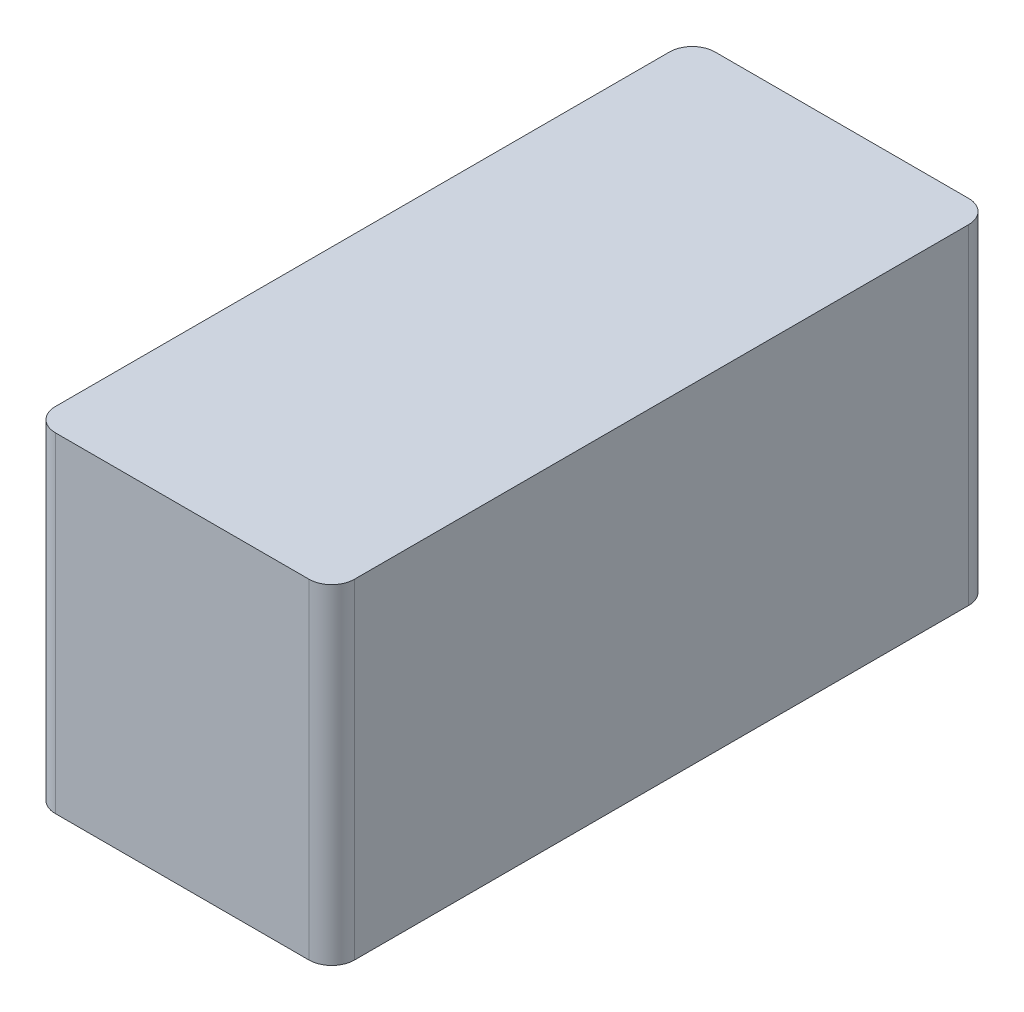
ISO-10303-21;
HEADER;
FILE_DESCRIPTION(('STEP AP214'),'2;1');
FILE_NAME('part.step','',(''),(''),'','','');
FILE_SCHEMA(('AUTOMOTIVE_DESIGN { 1 0 10303 214 1 1 1 1 }'));
ENDSEC;
DATA;
#1=APPLICATION_CONTEXT('core data for automotive mechanical design processes');
#2=APPLICATION_PROTOCOL_DEFINITION('international standard','automotive_design',2000,#1);
#3=PRODUCT_CONTEXT('',#1,'mechanical');
#4=PRODUCT('Part','Part','',(#3));
#5=PRODUCT_RELATED_PRODUCT_CATEGORY('part','',(#4));
#6=PRODUCT_DEFINITION_FORMATION('','',#4);
#7=PRODUCT_DEFINITION_CONTEXT('part definition',#1,'design');
#8=PRODUCT_DEFINITION('design','',#6,#7);
#9=PRODUCT_DEFINITION_SHAPE('','',#8);
#10=(LENGTH_UNIT() NAMED_UNIT(*) SI_UNIT(.MILLI.,.METRE.));
#11=(NAMED_UNIT(*) PLANE_ANGLE_UNIT() SI_UNIT($,.RADIAN.));
#12=(NAMED_UNIT(*) SI_UNIT($,.STERADIAN.) SOLID_ANGLE_UNIT());
#13=UNCERTAINTY_MEASURE_WITH_UNIT(LENGTH_MEASURE(1.E-05),#10,'distance_accuracy_value','');
#14=(GEOMETRIC_REPRESENTATION_CONTEXT(3) GLOBAL_UNCERTAINTY_ASSIGNED_CONTEXT((#13)) GLOBAL_UNIT_ASSIGNED_CONTEXT((#10,
#11,#12)) REPRESENTATION_CONTEXT('',''));
#15=CARTESIAN_POINT('',(0.,0.,0.));
#16=DIRECTION('',(0.,0.,1.));
#17=DIRECTION('',(1.,0.,0.));
#18=AXIS2_PLACEMENT_3D('',#15,#16,#17);
#19=CARTESIAN_POINT('',(-6.575,14.5,14.5));
#20=DIRECTION('',(1.,0.,0.));
#21=DIRECTION('',(0.,0.,-1.));
#22=AXIS2_PLACEMENT_3D('',#19,#20,#21);
#23=PLANE('',#22);
#24=DIRECTION('',(0.,0.,1.));
#25=VECTOR('',#24,1.);
#26=CARTESIAN_POINT('',(-6.575,14.5,14.5));
#27=LINE('',#26,#25);
#28=CARTESIAN_POINT('',(-6.575,14.5,-13.5));
#29=VERTEX_POINT('',#28);
#30=CARTESIAN_POINT('',(-6.575,14.5,13.5));
#31=VERTEX_POINT('',#30);
#32=EDGE_CURVE('E122',#29,#31,#27,.T.);
#33=ORIENTED_EDGE('',*,*,#32,.F.);
#34=DIRECTION('',(0.,-1.,0.));
#35=VECTOR('',#34,1.);
#36=CARTESIAN_POINT('',(-6.575,14.5,-13.5));
#37=LINE('',#36,#35);
#38=CARTESIAN_POINT('',(-6.575,0.,-13.5));
#39=VERTEX_POINT('',#38);
#40=EDGE_CURVE('E107',#29,#39,#37,.T.);
#41=ORIENTED_EDGE('',*,*,#40,.T.);
#42=DIRECTION('',(0.,0.,1.));
#43=VECTOR('',#42,1.);
#44=CARTESIAN_POINT('',(-6.575,0.,14.5));
#45=LINE('',#44,#43);
#46=CARTESIAN_POINT('',(-6.575,0.,13.5));
#47=VERTEX_POINT('',#46);
#48=EDGE_CURVE('E119',#39,#47,#45,.T.);
#49=ORIENTED_EDGE('',*,*,#48,.T.);
#50=DIRECTION('',(0.,-1.,0.));
#51=VECTOR('',#50,1.);
#52=CARTESIAN_POINT('',(-6.575,14.5,13.5));
#53=LINE('',#52,#51);
#54=EDGE_CURVE('E124',#47,#31,#53,.F.);
#55=ORIENTED_EDGE('',*,*,#54,.T.);
#56=EDGE_LOOP('',(#33,#41,#49,#55));
#57=FACE_BOUND('',#56,.T.);
#58=ADVANCED_FACE('F36',(#57),#23,.F.);
#59=CARTESIAN_POINT('',(6.575,14.5,14.5));
#60=DIRECTION('',(0.,0.,-1.));
#61=DIRECTION('',(-1.,0.,0.));
#62=AXIS2_PLACEMENT_3D('',#59,#60,#61);
#63=PLANE('',#62);
#64=DIRECTION('',(1.,0.,0.));
#65=VECTOR('',#64,1.);
#66=CARTESIAN_POINT('',(6.575,14.5,14.5));
#67=LINE('',#66,#65);
#68=CARTESIAN_POINT('',(-5.575,14.5,14.5));
#69=VERTEX_POINT('',#68);
#70=CARTESIAN_POINT('',(5.575,14.5,14.5));
#71=VERTEX_POINT('',#70);
#72=EDGE_CURVE('E162',#69,#71,#67,.T.);
#73=ORIENTED_EDGE('',*,*,#72,.F.);
#74=DIRECTION('',(0.,-1.,0.));
#75=VECTOR('',#74,1.);
#76=CARTESIAN_POINT('',(-5.575,14.5,14.5));
#77=LINE('',#76,#75);
#78=CARTESIAN_POINT('',(-5.575,0.,14.5));
#79=VERTEX_POINT('',#78);
#80=EDGE_CURVE('E11',#69,#79,#77,.T.);
#81=ORIENTED_EDGE('',*,*,#80,.T.);
#82=DIRECTION('',(1.,0.,0.));
#83=VECTOR('',#82,1.);
#84=CARTESIAN_POINT('',(6.575,0.,14.5));
#85=LINE('',#84,#83);
#86=CARTESIAN_POINT('',(5.575,0.,14.5));
#87=VERTEX_POINT('',#86);
#88=EDGE_CURVE('E129',#79,#87,#85,.T.);
#89=ORIENTED_EDGE('',*,*,#88,.T.);
#90=DIRECTION('',(0.,-1.,0.));
#91=VECTOR('',#90,1.);
#92=CARTESIAN_POINT('',(5.575,14.5,14.5));
#93=LINE('',#92,#91);
#94=EDGE_CURVE('E44',#87,#71,#93,.F.);
#95=ORIENTED_EDGE('',*,*,#94,.T.);
#96=EDGE_LOOP('',(#73,#81,#89,#95));
#97=FACE_BOUND('',#96,.T.);
#98=ADVANCED_FACE('F161',(#97),#63,.F.);
#99=CARTESIAN_POINT('',(6.575,14.5,14.5));
#100=DIRECTION('',(-1.,0.,0.));
#101=DIRECTION('',(0.,0.,1.));
#102=AXIS2_PLACEMENT_3D('',#99,#100,#101);
#103=PLANE('',#102);
#104=DIRECTION('',(0.,0.,-1.));
#105=VECTOR('',#104,1.);
#106=CARTESIAN_POINT('',(6.575,0.,14.5));
#107=LINE('',#106,#105);
#108=CARTESIAN_POINT('',(6.575,0.,13.5));
#109=VERTEX_POINT('',#108);
#110=CARTESIAN_POINT('',(6.575,0.,-13.5));
#111=VERTEX_POINT('',#110);
#112=EDGE_CURVE('E132',#109,#111,#107,.T.);
#113=ORIENTED_EDGE('',*,*,#112,.T.);
#114=DIRECTION('',(0.,-1.,0.));
#115=VECTOR('',#114,1.);
#116=CARTESIAN_POINT('',(6.575,14.5,-13.5));
#117=LINE('',#116,#115);
#118=CARTESIAN_POINT('',(6.575,14.5,-13.5));
#119=VERTEX_POINT('',#118);
#120=EDGE_CURVE('E51',#111,#119,#117,.F.);
#121=ORIENTED_EDGE('',*,*,#120,.T.);
#122=DIRECTION('',(0.,0.,-1.));
#123=VECTOR('',#122,1.);
#124=CARTESIAN_POINT('',(6.575,14.5,14.5));
#125=LINE('',#124,#123);
#126=CARTESIAN_POINT('',(6.575,14.5,13.5));
#127=VERTEX_POINT('',#126);
#128=EDGE_CURVE('E168',#127,#119,#125,.T.);
#129=ORIENTED_EDGE('',*,*,#128,.F.);
#130=DIRECTION('',(0.,-1.,0.));
#131=VECTOR('',#130,1.);
#132=CARTESIAN_POINT('',(6.575,14.5,13.5));
#133=LINE('',#132,#131);
#134=EDGE_CURVE('E155',#127,#109,#133,.T.);
#135=ORIENTED_EDGE('',*,*,#134,.T.);
#136=EDGE_LOOP('',(#113,#121,#129,#135));
#137=FACE_BOUND('',#136,.T.);
#138=ADVANCED_FACE('F172',(#137),#103,.F.);
#139=CARTESIAN_POINT('',(6.575,14.5,-14.5));
#140=DIRECTION('',(0.,0.,1.));
#141=DIRECTION('',(1.,0.,0.));
#142=AXIS2_PLACEMENT_3D('',#139,#140,#141);
#143=PLANE('',#142);
#144=DIRECTION('',(-1.,0.,0.));
#145=VECTOR('',#144,1.);
#146=CARTESIAN_POINT('',(6.575,0.,-14.5));
#147=LINE('',#146,#145);
#148=CARTESIAN_POINT('',(5.575,0.,-14.5));
#149=VERTEX_POINT('',#148);
#150=CARTESIAN_POINT('',(-5.575,0.,-14.5));
#151=VERTEX_POINT('',#150);
#152=EDGE_CURVE('E139',#149,#151,#147,.T.);
#153=ORIENTED_EDGE('',*,*,#152,.T.);
#154=DIRECTION('',(0.,-1.,0.));
#155=VECTOR('',#154,1.);
#156=CARTESIAN_POINT('',(-5.575,14.5,-14.5));
#157=LINE('',#156,#155);
#158=CARTESIAN_POINT('',(-5.575,14.5,-14.5));
#159=VERTEX_POINT('',#158);
#160=EDGE_CURVE('E108',#151,#159,#157,.F.);
#161=ORIENTED_EDGE('',*,*,#160,.T.);
#162=DIRECTION('',(-1.,0.,0.));
#163=VECTOR('',#162,1.);
#164=CARTESIAN_POINT('',(6.575,14.5,-14.5));
#165=LINE('',#164,#163);
#166=CARTESIAN_POINT('',(5.575,14.5,-14.5));
#167=VERTEX_POINT('',#166);
#168=EDGE_CURVE('E135',#167,#159,#165,.T.);
#169=ORIENTED_EDGE('',*,*,#168,.F.);
#170=DIRECTION('',(0.,-1.,0.));
#171=VECTOR('',#170,1.);
#172=CARTESIAN_POINT('',(5.575,14.5,-14.5));
#173=LINE('',#172,#171);
#174=EDGE_CURVE('E113',#167,#149,#173,.T.);
#175=ORIENTED_EDGE('',*,*,#174,.T.);
#176=EDGE_LOOP('',(#153,#161,#169,#175));
#177=FACE_BOUND('',#176,.T.);
#178=ADVANCED_FACE('F179',(#177),#143,.F.);
#179=CARTESIAN_POINT('',(-6.575,14.5,-14.5));
#180=DIRECTION('',(0.,1.,0.));
#181=DIRECTION('',(0.,0.,1.));
#182=AXIS2_PLACEMENT_3D('',#179,#180,#181);
#183=PLANE('',#182);
#184=ORIENTED_EDGE('',*,*,#168,.T.);
#185=CARTESIAN_POINT('',(-5.575,14.5,-13.5));
#186=DIRECTION('',(0.,1.,0.));
#187=DIRECTION('',(0.,0.,1.));
#188=AXIS2_PLACEMENT_3D('',#185,#186,#187);
#189=CIRCLE('',#188,1.);
#190=EDGE_CURVE('E153',#159,#29,#189,.T.);
#191=ORIENTED_EDGE('',*,*,#190,.T.);
#192=ORIENTED_EDGE('',*,*,#32,.T.);
#193=CARTESIAN_POINT('',(-5.575,14.5,13.5));
#194=DIRECTION('',(0.,1.,0.));
#195=DIRECTION('',(0.,0.,1.));
#196=AXIS2_PLACEMENT_3D('',#193,#194,#195);
#197=CIRCLE('',#196,1.);
#198=EDGE_CURVE('E149',#31,#69,#197,.T.);
#199=ORIENTED_EDGE('',*,*,#198,.T.);
#200=ORIENTED_EDGE('',*,*,#72,.T.);
#201=CARTESIAN_POINT('',(5.575,14.5,13.5));
#202=DIRECTION('',(0.,1.,0.));
#203=DIRECTION('',(0.,0.,1.));
#204=AXIS2_PLACEMENT_3D('',#201,#202,#203);
#205=CIRCLE('',#204,1.);
#206=EDGE_CURVE('E58',#71,#127,#205,.T.);
#207=ORIENTED_EDGE('',*,*,#206,.T.);
#208=ORIENTED_EDGE('',*,*,#128,.T.);
#209=CARTESIAN_POINT('',(5.575,14.5,-13.5));
#210=DIRECTION('',(0.,1.,0.));
#211=DIRECTION('',(0.,0.,1.));
#212=AXIS2_PLACEMENT_3D('',#209,#210,#211);
#213=CIRCLE('',#212,1.);
#214=EDGE_CURVE('E151',#119,#167,#213,.T.);
#215=ORIENTED_EDGE('',*,*,#214,.T.);
#216=EDGE_LOOP('',(#184,#191,#192,#199,#200,#207,#208,#215));
#217=FACE_BOUND('',#216,.T.);
#218=ADVANCED_FACE('F166',(#217),#183,.T.);
#219=CARTESIAN_POINT('',(-6.575,0.,-14.5));
#220=DIRECTION('',(0.,1.,0.));
#221=DIRECTION('',(0.,0.,1.));
#222=AXIS2_PLACEMENT_3D('',#219,#220,#221);
#223=PLANE('',#222);
#224=ORIENTED_EDGE('',*,*,#48,.F.);
#225=CARTESIAN_POINT('',(-5.575,0.,-13.5));
#226=DIRECTION('',(0.,1.,0.));
#227=DIRECTION('',(0.,0.,1.));
#228=AXIS2_PLACEMENT_3D('',#225,#226,#227);
#229=CIRCLE('',#228,1.);
#230=EDGE_CURVE('E103',#39,#151,#229,.F.);
#231=ORIENTED_EDGE('',*,*,#230,.T.);
#232=ORIENTED_EDGE('',*,*,#152,.F.);
#233=CARTESIAN_POINT('',(5.575,0.,-13.5));
#234=DIRECTION('',(0.,1.,0.));
#235=DIRECTION('',(0.,0.,1.));
#236=AXIS2_PLACEMENT_3D('',#233,#234,#235);
#237=CIRCLE('',#236,1.);
#238=EDGE_CURVE('E114',#149,#111,#237,.F.);
#239=ORIENTED_EDGE('',*,*,#238,.T.);
#240=ORIENTED_EDGE('',*,*,#112,.F.);
#241=CARTESIAN_POINT('',(5.575,0.,13.5));
#242=DIRECTION('',(0.,1.,0.));
#243=DIRECTION('',(0.,0.,1.));
#244=AXIS2_PLACEMENT_3D('',#241,#242,#243);
#245=CIRCLE('',#244,1.);
#246=EDGE_CURVE('E123',#109,#87,#245,.F.);
#247=ORIENTED_EDGE('',*,*,#246,.T.);
#248=ORIENTED_EDGE('',*,*,#88,.F.);
#249=CARTESIAN_POINT('',(-5.575,0.,13.5));
#250=DIRECTION('',(0.,1.,0.));
#251=DIRECTION('',(0.,0.,1.));
#252=AXIS2_PLACEMENT_3D('',#249,#250,#251);
#253=CIRCLE('',#252,1.);
#254=EDGE_CURVE('E128',#79,#47,#253,.F.);
#255=ORIENTED_EDGE('',*,*,#254,.T.);
#256=EDGE_LOOP('',(#224,#231,#232,#239,#240,#247,#248,#255));
#257=FACE_BOUND('',#256,.T.);
#258=ADVANCED_FACE('F126',(#257),#223,.F.);
#259=CARTESIAN_POINT('',(-5.575,14.5,-13.5));
#260=DIRECTION('',(0.,-1.,0.));
#261=DIRECTION('',(0.,0.,-1.));
#262=AXIS2_PLACEMENT_3D('',#259,#260,#261);
#263=CYLINDRICAL_SURFACE('',#262,1.);
#264=ORIENTED_EDGE('',*,*,#190,.F.);
#265=ORIENTED_EDGE('',*,*,#160,.F.);
#266=ORIENTED_EDGE('',*,*,#230,.F.);
#267=ORIENTED_EDGE('',*,*,#40,.F.);
#268=EDGE_LOOP('',(#264,#265,#266,#267));
#269=FACE_BOUND('',#268,.T.);
#270=ADVANCED_FACE('F106',(#269),#263,.T.);
#271=CARTESIAN_POINT('',(5.575,14.5,-13.5));
#272=DIRECTION('',(0.,-1.,0.));
#273=DIRECTION('',(0.,0.,-1.));
#274=AXIS2_PLACEMENT_3D('',#271,#272,#273);
#275=CYLINDRICAL_SURFACE('',#274,1.);
#276=ORIENTED_EDGE('',*,*,#214,.F.);
#277=ORIENTED_EDGE('',*,*,#120,.F.);
#278=ORIENTED_EDGE('',*,*,#238,.F.);
#279=ORIENTED_EDGE('',*,*,#174,.F.);
#280=EDGE_LOOP('',(#276,#277,#278,#279));
#281=FACE_BOUND('',#280,.T.);
#282=ADVANCED_FACE('F176',(#281),#275,.T.);
#283=CARTESIAN_POINT('',(-5.575,14.5,13.5));
#284=DIRECTION('',(0.,-1.,0.));
#285=DIRECTION('',(0.,0.,-1.));
#286=AXIS2_PLACEMENT_3D('',#283,#284,#285);
#287=CYLINDRICAL_SURFACE('',#286,1.);
#288=ORIENTED_EDGE('',*,*,#198,.F.);
#289=ORIENTED_EDGE('',*,*,#54,.F.);
#290=ORIENTED_EDGE('',*,*,#254,.F.);
#291=ORIENTED_EDGE('',*,*,#80,.F.);
#292=EDGE_LOOP('',(#288,#289,#290,#291));
#293=FACE_BOUND('',#292,.T.);
#294=ADVANCED_FACE('F182',(#293),#287,.T.);
#295=CARTESIAN_POINT('',(5.575,14.5,13.5));
#296=DIRECTION('',(0.,-1.,0.));
#297=DIRECTION('',(0.,0.,-1.));
#298=AXIS2_PLACEMENT_3D('',#295,#296,#297);
#299=CYLINDRICAL_SURFACE('',#298,1.);
#300=ORIENTED_EDGE('',*,*,#206,.F.);
#301=ORIENTED_EDGE('',*,*,#94,.F.);
#302=ORIENTED_EDGE('',*,*,#246,.F.);
#303=ORIENTED_EDGE('',*,*,#134,.F.);
#304=EDGE_LOOP('',(#300,#301,#302,#303));
#305=FACE_BOUND('',#304,.T.);
#306=ADVANCED_FACE('F38',(#305),#299,.T.);
#307=CLOSED_SHELL('',(#58,#98,#138,#178,#218,#258,#270,#282,#294,#306));
#308=MANIFOLD_SOLID_BREP('B2',#307);
#309=ADVANCED_BREP_SHAPE_REPRESENTATION('',(#18,#308),#14);
#310=SHAPE_DEFINITION_REPRESENTATION(#9,#309);
ENDSEC;
END-ISO-10303-21;
